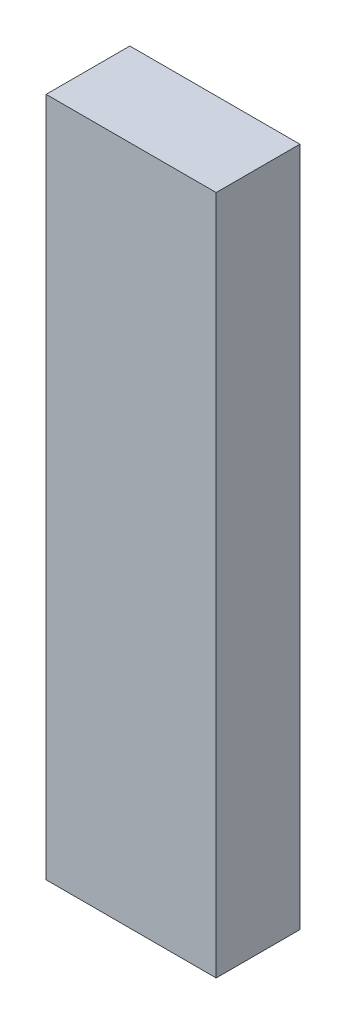
ISO-10303-21;
HEADER;
FILE_DESCRIPTION(('STEP AP214'),'2;1');
FILE_NAME('part.step','',(''),(''),'','','');
FILE_SCHEMA(('AUTOMOTIVE_DESIGN { 1 0 10303 214 1 1 1 1 }'));
ENDSEC;
DATA;
#1=APPLICATION_CONTEXT('core data for automotive mechanical design processes');
#2=APPLICATION_PROTOCOL_DEFINITION('international standard','automotive_design',2000,#1);
#3=PRODUCT_CONTEXT('',#1,'mechanical');
#4=PRODUCT('Part','Part','',(#3));
#5=PRODUCT_RELATED_PRODUCT_CATEGORY('part','',(#4));
#6=PRODUCT_DEFINITION_FORMATION('','',#4);
#7=PRODUCT_DEFINITION_CONTEXT('part definition',#1,'design');
#8=PRODUCT_DEFINITION('design','',#6,#7);
#9=PRODUCT_DEFINITION_SHAPE('','',#8);
#10=(LENGTH_UNIT() NAMED_UNIT(*) SI_UNIT(.MILLI.,.METRE.));
#11=(NAMED_UNIT(*) PLANE_ANGLE_UNIT() SI_UNIT($,.RADIAN.));
#12=(NAMED_UNIT(*) SI_UNIT($,.STERADIAN.) SOLID_ANGLE_UNIT());
#13=UNCERTAINTY_MEASURE_WITH_UNIT(LENGTH_MEASURE(1.E-05),#10,'distance_accuracy_value','');
#14=(GEOMETRIC_REPRESENTATION_CONTEXT(3) GLOBAL_UNCERTAINTY_ASSIGNED_CONTEXT((#13)) GLOBAL_UNIT_ASSIGNED_CONTEXT((#10,
#11,#12)) REPRESENTATION_CONTEXT('',''));
#15=CARTESIAN_POINT('',(0.,0.,0.));
#16=DIRECTION('',(0.,0.,1.));
#17=DIRECTION('',(1.,0.,0.));
#18=AXIS2_PLACEMENT_3D('',#15,#16,#17);
#19=CARTESIAN_POINT('',(-0.3250057,0.68579492,0.31999936));
#20=DIRECTION('',(0.,0.,-1.));
#21=DIRECTION('',(-1.,0.,0.));
#22=AXIS2_PLACEMENT_3D('',#19,#20,#21);
#23=PLANE('',#22);
#24=DIRECTION('',(0.,1.,0.));
#25=VECTOR('',#24,1.);
#26=CARTESIAN_POINT('',(0.32499554,-1.91420496,0.31999936));
#27=LINE('',#26,#25);
#28=CARTESIAN_POINT('',(0.32499554,-1.91420496,0.31999936));
#29=VERTEX_POINT('',#28);
#30=CARTESIAN_POINT('',(0.32499554,0.68579492,0.31999936));
#31=VERTEX_POINT('',#30);
#32=EDGE_CURVE('E80',#29,#31,#27,.T.);
#33=ORIENTED_EDGE('',*,*,#32,.T.);
#34=DIRECTION('',(1.,0.,0.));
#35=VECTOR('',#34,1.);
#36=CARTESIAN_POINT('',(0.32499554,0.68579492,0.31999936));
#37=LINE('',#36,#35);
#38=CARTESIAN_POINT('',(-0.3250057,0.68579492,0.31999936));
#39=VERTEX_POINT('',#38);
#40=EDGE_CURVE('E55',#31,#39,#37,.F.);
#41=ORIENTED_EDGE('',*,*,#40,.T.);
#42=DIRECTION('',(0.,1.,0.));
#43=VECTOR('',#42,1.);
#44=CARTESIAN_POINT('',(-0.3250057,0.68579492,0.31999936));
#45=LINE('',#44,#43);
#46=CARTESIAN_POINT('',(-0.3250057,-1.91420496,0.31999936));
#47=VERTEX_POINT('',#46);
#48=EDGE_CURVE('E57',#39,#47,#45,.F.);
#49=ORIENTED_EDGE('',*,*,#48,.T.);
#50=DIRECTION('',(1.,0.,0.));
#51=VECTOR('',#50,1.);
#52=CARTESIAN_POINT('',(-0.3250057,-1.91420496,0.31999936));
#53=LINE('',#52,#51);
#54=EDGE_CURVE('E20',#47,#29,#53,.T.);
#55=ORIENTED_EDGE('',*,*,#54,.T.);
#56=EDGE_LOOP('',(#33,#41,#49,#55));
#57=FACE_BOUND('',#56,.T.);
#58=ADVANCED_FACE('F17',(#57),#23,.F.);
#59=CARTESIAN_POINT('',(-0.3250057,-1.91420496,0.));
#60=DIRECTION('',(0.,1.,0.));
#61=DIRECTION('',(0.,0.,1.));
#62=AXIS2_PLACEMENT_3D('',#59,#60,#61);
#63=PLANE('',#62);
#64=ORIENTED_EDGE('',*,*,#54,.F.);
#65=DIRECTION('',(0.,0.,-1.));
#66=VECTOR('',#65,1.);
#67=CARTESIAN_POINT('',(-0.3250057,-1.91420496,0.));
#68=LINE('',#67,#66);
#69=CARTESIAN_POINT('',(-0.3250057,-1.91420496,0.));
#70=VERTEX_POINT('',#69);
#71=EDGE_CURVE('E63',#47,#70,#68,.T.);
#72=ORIENTED_EDGE('',*,*,#71,.T.);
#73=DIRECTION('',(-1.,0.,0.));
#74=VECTOR('',#73,1.);
#75=CARTESIAN_POINT('',(-0.3250057,-1.91420496,0.));
#76=LINE('',#75,#74);
#77=CARTESIAN_POINT('',(0.32499554,-1.91420496,0.));
#78=VERTEX_POINT('',#77);
#79=EDGE_CURVE('E83',#78,#70,#76,.T.);
#80=ORIENTED_EDGE('',*,*,#79,.F.);
#81=DIRECTION('',(0.,0.,1.));
#82=VECTOR('',#81,1.);
#83=CARTESIAN_POINT('',(0.32499554,-1.91420496,0.));
#84=LINE('',#83,#82);
#85=EDGE_CURVE('E68',#78,#29,#84,.T.);
#86=ORIENTED_EDGE('',*,*,#85,.T.);
#87=EDGE_LOOP('',(#64,#72,#80,#86));
#88=FACE_BOUND('',#87,.T.);
#89=ADVANCED_FACE('F65',(#88),#63,.F.);
#90=CARTESIAN_POINT('',(-0.3250057,0.68579492,0.));
#91=DIRECTION('',(1.,0.,0.));
#92=DIRECTION('',(0.,0.,-1.));
#93=AXIS2_PLACEMENT_3D('',#90,#91,#92);
#94=PLANE('',#93);
#95=ORIENTED_EDGE('',*,*,#48,.F.);
#96=DIRECTION('',(0.,0.,-1.));
#97=VECTOR('',#96,1.);
#98=CARTESIAN_POINT('',(-0.3250057,0.68579492,0.));
#99=LINE('',#98,#97);
#100=CARTESIAN_POINT('',(-0.3250057,0.68579492,0.));
#101=VERTEX_POINT('',#100);
#102=EDGE_CURVE('E75',#39,#101,#99,.T.);
#103=ORIENTED_EDGE('',*,*,#102,.T.);
#104=DIRECTION('',(0.,1.,0.));
#105=VECTOR('',#104,1.);
#106=CARTESIAN_POINT('',(-0.3250057,0.68579492,0.));
#107=LINE('',#106,#105);
#108=EDGE_CURVE('E72',#70,#101,#107,.T.);
#109=ORIENTED_EDGE('',*,*,#108,.F.);
#110=ORIENTED_EDGE('',*,*,#71,.F.);
#111=EDGE_LOOP('',(#95,#103,#109,#110));
#112=FACE_BOUND('',#111,.T.);
#113=ADVANCED_FACE('F70',(#112),#94,.F.);
#114=CARTESIAN_POINT('',(0.32499554,0.68579492,0.));
#115=DIRECTION('',(0.,-1.,0.));
#116=DIRECTION('',(0.,0.,-1.));
#117=AXIS2_PLACEMENT_3D('',#114,#115,#116);
#118=PLANE('',#117);
#119=ORIENTED_EDGE('',*,*,#40,.F.);
#120=DIRECTION('',(0.,0.,1.));
#121=VECTOR('',#120,1.);
#122=CARTESIAN_POINT('',(0.32499554,0.68579492,0.));
#123=LINE('',#122,#121);
#124=CARTESIAN_POINT('',(0.32499554,0.68579492,0.));
#125=VERTEX_POINT('',#124);
#126=EDGE_CURVE('E35',#31,#125,#123,.F.);
#127=ORIENTED_EDGE('',*,*,#126,.T.);
#128=DIRECTION('',(-1.,0.,0.));
#129=VECTOR('',#128,1.);
#130=CARTESIAN_POINT('',(-0.3250057,0.68579492,0.));
#131=LINE('',#130,#129);
#132=EDGE_CURVE('E26',#101,#125,#131,.F.);
#133=ORIENTED_EDGE('',*,*,#132,.F.);
#134=ORIENTED_EDGE('',*,*,#102,.F.);
#135=EDGE_LOOP('',(#119,#127,#133,#134));
#136=FACE_BOUND('',#135,.T.);
#137=ADVANCED_FACE('F89',(#136),#118,.F.);
#138=CARTESIAN_POINT('',(0.32499554,-1.91420496,0.));
#139=DIRECTION('',(-1.,0.,0.));
#140=DIRECTION('',(0.,0.,1.));
#141=AXIS2_PLACEMENT_3D('',#138,#139,#140);
#142=PLANE('',#141);
#143=ORIENTED_EDGE('',*,*,#32,.F.);
#144=ORIENTED_EDGE('',*,*,#85,.F.);
#145=DIRECTION('',(0.,1.,0.));
#146=VECTOR('',#145,1.);
#147=CARTESIAN_POINT('',(0.32499554,0.68579492,0.));
#148=LINE('',#147,#146);
#149=EDGE_CURVE('E11',#125,#78,#148,.F.);
#150=ORIENTED_EDGE('',*,*,#149,.F.);
#151=ORIENTED_EDGE('',*,*,#126,.F.);
#152=EDGE_LOOP('',(#143,#144,#150,#151));
#153=FACE_BOUND('',#152,.T.);
#154=ADVANCED_FACE('F91',(#153),#142,.F.);
#155=CARTESIAN_POINT('',(-0.3250057,0.68579492,0.));
#156=DIRECTION('',(0.,0.,-1.));
#157=DIRECTION('',(-1.,0.,0.));
#158=AXIS2_PLACEMENT_3D('',#155,#156,#157);
#159=PLANE('',#158);
#160=ORIENTED_EDGE('',*,*,#132,.T.);
#161=ORIENTED_EDGE('',*,*,#149,.T.);
#162=ORIENTED_EDGE('',*,*,#79,.T.);
#163=ORIENTED_EDGE('',*,*,#108,.T.);
#164=EDGE_LOOP('',(#160,#161,#162,#163));
#165=FACE_BOUND('',#164,.T.);
#166=ADVANCED_FACE('F88',(#165),#159,.T.);
#167=CLOSED_SHELL('',(#58,#89,#113,#137,#154,#166));
#168=MANIFOLD_SOLID_BREP('B1',#167);
#169=ADVANCED_BREP_SHAPE_REPRESENTATION('',(#18,#168),#14);
#170=SHAPE_DEFINITION_REPRESENTATION(#9,#169);
ENDSEC;
END-ISO-10303-21;
